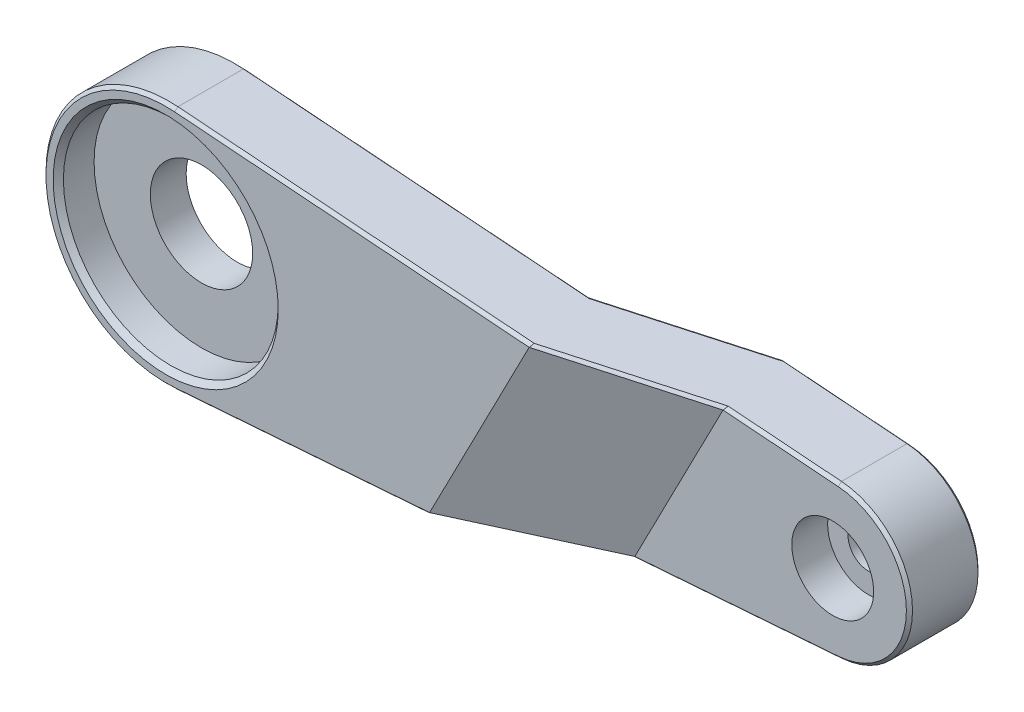
ISO-10303-21;
HEADER;
FILE_DESCRIPTION(('STEP AP214'),'2;1');
FILE_NAME('part.step','',(''),(''),'','','');
FILE_SCHEMA(('AUTOMOTIVE_DESIGN { 1 0 10303 214 1 1 1 1 }'));
ENDSEC;
DATA;
#1=APPLICATION_CONTEXT('core data for automotive mechanical design processes');
#2=APPLICATION_PROTOCOL_DEFINITION('international standard','automotive_design',2000,#1);
#3=PRODUCT_CONTEXT('',#1,'mechanical');
#4=PRODUCT('Part','Part','',(#3));
#5=PRODUCT_RELATED_PRODUCT_CATEGORY('part','',(#4));
#6=PRODUCT_DEFINITION_FORMATION('','',#4);
#7=PRODUCT_DEFINITION_CONTEXT('part definition',#1,'design');
#8=PRODUCT_DEFINITION('design','',#6,#7);
#9=PRODUCT_DEFINITION_SHAPE('','',#8);
#10=(LENGTH_UNIT() NAMED_UNIT(*) SI_UNIT(.MILLI.,.METRE.));
#11=(NAMED_UNIT(*) PLANE_ANGLE_UNIT() SI_UNIT($,.RADIAN.));
#12=(NAMED_UNIT(*) SI_UNIT($,.STERADIAN.) SOLID_ANGLE_UNIT());
#13=UNCERTAINTY_MEASURE_WITH_UNIT(LENGTH_MEASURE(1.E-05),#10,'distance_accuracy_value','');
#14=(GEOMETRIC_REPRESENTATION_CONTEXT(3) GLOBAL_UNCERTAINTY_ASSIGNED_CONTEXT((#13)) GLOBAL_UNIT_ASSIGNED_CONTEXT((#10,
#11,#12)) REPRESENTATION_CONTEXT('',''));
#15=CARTESIAN_POINT('',(0.,0.,0.));
#16=DIRECTION('',(0.,0.,1.));
#17=DIRECTION('',(1.,0.,0.));
#18=AXIS2_PLACEMENT_3D('',#15,#16,#17);
#19=CARTESIAN_POINT('',(0.,0.,7.));
#20=DIRECTION('',(0.,0.,-1.));
#21=DIRECTION('',(-1.,0.,0.));
#22=AXIS2_PLACEMENT_3D('',#19,#20,#21);
#23=CYLINDRICAL_SURFACE('',#22,12.);
#24=DIRECTION('',(0.,0.,-1.));
#25=VECTOR('',#24,1.);
#26=CARTESIAN_POINT('',(0.9,11.9662024051075,7.));
#27=LINE('',#26,#25);
#28=CARTESIAN_POINT('',(0.9,11.9662024051075,6.69999999999998));
#29=VERTEX_POINT('',#28);
#30=CARTESIAN_POINT('',(0.9,11.9662024051075,0.300000000000002));
#31=VERTEX_POINT('',#30);
#32=EDGE_CURVE('E383',#29,#31,#27,.T.);
#33=ORIENTED_EDGE('',*,*,#32,.T.);
#34=CARTESIAN_POINT('',(0.,0.,0.300000000000002));
#35=DIRECTION('',(0.,0.,1.));
#36=DIRECTION('',(1.,0.,0.));
#37=AXIS2_PLACEMENT_3D('',#34,#35,#36);
#38=CIRCLE('',#37,12.);
#39=CARTESIAN_POINT('',(0.9,-11.9662024051075,0.300000000000002));
#40=VERTEX_POINT('',#39);
#41=EDGE_CURVE('E200',#31,#40,#38,.T.);
#42=ORIENTED_EDGE('',*,*,#41,.T.);
#43=DIRECTION('',(0.,0.,-1.));
#44=VECTOR('',#43,1.);
#45=CARTESIAN_POINT('',(0.9,-11.9662024051075,7.));
#46=LINE('',#45,#44);
#47=CARTESIAN_POINT('',(0.9,-11.9662024051075,6.69999999999998));
#48=VERTEX_POINT('',#47);
#49=EDGE_CURVE('E185',#48,#40,#46,.T.);
#50=ORIENTED_EDGE('',*,*,#49,.F.);
#51=CARTESIAN_POINT('',(0.,0.,6.69999999999998));
#52=DIRECTION('',(0.,0.,1.));
#53=DIRECTION('',(1.,0.,0.));
#54=AXIS2_PLACEMENT_3D('',#51,#52,#53);
#55=CIRCLE('',#54,12.);
#56=EDGE_CURVE('E197',#48,#29,#55,.F.);
#57=ORIENTED_EDGE('',*,*,#56,.T.);
#58=EDGE_LOOP('',(#33,#42,#50,#57));
#59=FACE_BOUND('',#58,.T.);
#60=ADVANCED_FACE('F39',(#59),#23,.T.);
#61=CARTESIAN_POINT('',(0.9,-11.9662024051075,7.));
#62=DIRECTION('',(-0.075,0.997183533758957,0.));
#63=DIRECTION('',(-0.997183533758957,-0.075,0.));
#64=AXIS2_PLACEMENT_3D('',#61,#62,#63);
#65=PLANE('',#64);
#66=DIRECTION('',(0.941535676249198,0.070814622712933,-0.329387096832876));
#67=VECTOR('',#66,1.);
#68=CARTESIAN_POINT('',(1.35682953597985,-11.9318434189845,8.31320998572072));
#69=LINE('',#68,#67);
#70=CARTESIAN_POINT('',(24.2621684377657,-10.2090909271155,0.300000000000002));
#71=VERTEX_POINT('',#70);
#72=CARTESIAN_POINT('',(39.1260946922298,-9.09114780897909,-4.90000000000008));
#73=VERTEX_POINT('',#72);
#74=EDGE_CURVE('E419',#71,#73,#69,.T.);
#75=ORIENTED_EDGE('',*,*,#74,.T.);
#76=DIRECTION('',(0.997183533758957,0.075,0.));
#77=VECTOR('',#76,1.);
#78=CARTESIAN_POINT('',(60.5625,-7.47887650319217,-4.90000000000009));
#79=LINE('',#78,#77);
#80=CARTESIAN_POINT('',(60.5625,-7.47887650319218,-4.90000000000009));
#81=VERTEX_POINT('',#80);
#82=EDGE_CURVE('E356',#73,#81,#79,.T.);
#83=ORIENTED_EDGE('',*,*,#82,.T.);
#84=DIRECTION('',(0.,0.,-1.));
#85=VECTOR('',#84,1.);
#86=CARTESIAN_POINT('',(60.5625,-7.47887650319218,7.));
#87=LINE('',#86,#85);
#88=CARTESIAN_POINT('',(60.5625,-7.47887650319218,1.49999999999995));
#89=VERTEX_POINT('',#88);
#90=EDGE_CURVE('E202',#89,#81,#87,.T.);
#91=ORIENTED_EDGE('',*,*,#90,.F.);
#92=DIRECTION('',(-0.997183533758957,-0.075,0.));
#93=VECTOR('',#92,1.);
#94=CARTESIAN_POINT('',(0.900000000000104,-11.9662024051075,1.4999999999989));
#95=LINE('',#94,#93);
#96=CARTESIAN_POINT('',(40.1925645323235,-9.01093665897593,1.49999999999965));
#97=VERTEX_POINT('',#96);
#98=EDGE_CURVE('E416',#89,#97,#95,.T.);
#99=ORIENTED_EDGE('',*,*,#98,.T.);
#100=DIRECTION('',(-0.941535676249198,-0.070814622712933,0.329387096832876));
#101=VECTOR('',#100,1.);
#102=CARTESIAN_POINT('',(3.45736719694706,-11.7738581341908,14.3514514182674));
#103=LINE('',#102,#101);
#104=CARTESIAN_POINT('',(25.3286382778586,-10.1288797771124,6.69999999999998));
#105=VERTEX_POINT('',#104);
#106=EDGE_CURVE('E188',#97,#105,#103,.T.);
#107=ORIENTED_EDGE('',*,*,#106,.T.);
#108=DIRECTION('',(-0.997183533758957,-0.075,0.));
#109=VECTOR('',#108,1.);
#110=CARTESIAN_POINT('',(0.9,-11.9662024051075,6.69999999999998));
#111=LINE('',#110,#109);
#112=EDGE_CURVE('E181',#105,#48,#111,.T.);
#113=ORIENTED_EDGE('',*,*,#112,.T.);
#114=ORIENTED_EDGE('',*,*,#49,.T.);
#115=DIRECTION('',(0.997183533758957,0.075,0.));
#116=VECTOR('',#115,1.);
#117=CARTESIAN_POINT('',(0.9,-11.9662024051075,0.300000000000002));
#118=LINE('',#117,#116);
#119=EDGE_CURVE('E345',#40,#71,#118,.T.);
#120=ORIENTED_EDGE('',*,*,#119,.T.);
#121=EDGE_LOOP('',(#75,#83,#91,#99,#107,#113,#114,#120));
#122=FACE_BOUND('',#121,.T.);
#123=ADVANCED_FACE('F184',(#122),#65,.F.);
#124=CARTESIAN_POINT('',(60.,0.,7.));
#125=DIRECTION('',(0.,0.,-1.));
#126=DIRECTION('',(-1.,0.,0.));
#127=AXIS2_PLACEMENT_3D('',#124,#125,#126);
#128=CYLINDRICAL_SURFACE('',#127,7.5);
#129=DIRECTION('',(0.,0.,-1.));
#130=VECTOR('',#129,1.);
#131=CARTESIAN_POINT('',(60.5625,7.47887650319218,7.));
#132=LINE('',#131,#130);
#133=CARTESIAN_POINT('',(60.5625,7.47887650319218,1.49999999999989));
#134=VERTEX_POINT('',#133);
#135=CARTESIAN_POINT('',(60.5625,7.47887650319218,-4.90000000000009));
#136=VERTEX_POINT('',#135);
#137=EDGE_CURVE('E389',#134,#136,#132,.T.);
#138=ORIENTED_EDGE('',*,*,#137,.F.);
#139=CARTESIAN_POINT('',(60.,0.,1.49999999999995));
#140=DIRECTION('',(0.,0.,-1.));
#141=DIRECTION('',(-1.,0.,0.));
#142=AXIS2_PLACEMENT_3D('',#139,#140,#141);
#143=CIRCLE('',#142,7.5);
#144=EDGE_CURVE('E291',#134,#89,#143,.T.);
#145=ORIENTED_EDGE('',*,*,#144,.T.);
#146=ORIENTED_EDGE('',*,*,#90,.T.);
#147=CARTESIAN_POINT('',(60.,0.,-4.90000000000009));
#148=DIRECTION('',(0.,0.,-1.));
#149=DIRECTION('',(-1.,0.,0.));
#150=AXIS2_PLACEMENT_3D('',#147,#148,#149);
#151=CIRCLE('',#150,7.5);
#152=EDGE_CURVE('E289',#81,#136,#151,.F.);
#153=ORIENTED_EDGE('',*,*,#152,.T.);
#154=EDGE_LOOP('',(#138,#145,#146,#153));
#155=FACE_BOUND('',#154,.T.);
#156=ADVANCED_FACE('F391',(#155),#128,.T.);
#157=CARTESIAN_POINT('',(0.9,11.9662024051075,7.));
#158=DIRECTION('',(-0.075,-0.997183533758957,0.));
#159=DIRECTION('',(0.997183533758957,-0.075,0.));
#160=AXIS2_PLACEMENT_3D('',#157,#158,#159);
#161=PLANE('',#160);
#162=ORIENTED_EDGE('',*,*,#137,.T.);
#163=DIRECTION('',(-0.997183533758957,0.075,0.));
#164=VECTOR('',#163,1.);
#165=CARTESIAN_POINT('',(48.2409446123397,8.40560325186902,-4.90000000000009));
#166=LINE('',#165,#164);
#167=CARTESIAN_POINT('',(48.4559369675978,8.38943328305337,-4.90000000000009));
#168=VERTEX_POINT('',#167);
#169=EDGE_CURVE('E303',#136,#168,#166,.T.);
#170=ORIENTED_EDGE('',*,*,#169,.T.);
#171=DIRECTION('',(-0.933066204918891,0.0701776182616275,0.352792515699219));
#172=VECTOR('',#171,1.);
#173=CARTESIAN_POINT('',(2.9017062093807,11.8156504148057,12.3240636143617));
#174=LINE('',#173,#172);
#175=CARTESIAN_POINT('',(34.7029687223334,9.42381921450435,0.300000000000002));
#176=VERTEX_POINT('',#175);
#177=EDGE_CURVE('E301',#168,#176,#174,.T.);
#178=ORIENTED_EDGE('',*,*,#177,.T.);
#179=DIRECTION('',(-0.997183533758957,0.075,0.));
#180=VECTOR('',#179,1.);
#181=CARTESIAN_POINT('',(0.9,11.9662024051075,0.300000000000002));
#182=LINE('',#181,#180);
#183=EDGE_CURVE('E299',#176,#31,#182,.T.);
#184=ORIENTED_EDGE('',*,*,#183,.T.);
#185=ORIENTED_EDGE('',*,*,#32,.F.);
#186=DIRECTION('',(0.997183533758957,-0.075,0.));
#187=VECTOR('',#186,1.);
#188=CARTESIAN_POINT('',(35.6761386879196,9.3506253189495,6.69999999999998));
#189=LINE('',#188,#187);
#190=CARTESIAN_POINT('',(35.7238367707991,9.34703785877305,6.69999999999998));
#191=VERTEX_POINT('',#190);
#192=EDGE_CURVE('E293',#29,#191,#189,.T.);
#193=ORIENTED_EDGE('',*,*,#192,.T.);
#194=DIRECTION('',(0.933066204918891,-0.0701776182616275,-0.352792515699219));
#195=VECTOR('',#194,1.);
#196=CARTESIAN_POINT('',(5.13551021121271,11.647641924427,18.2654522916986));
#197=LINE('',#196,#195);
#198=CARTESIAN_POINT('',(49.4768050160642,8.31265192732204,1.49999999999966));
#199=VERTEX_POINT('',#198);
#200=EDGE_CURVE('E295',#191,#199,#197,.T.);
#201=ORIENTED_EDGE('',*,*,#200,.T.);
#202=DIRECTION('',(0.997183533758957,-0.075,0.));
#203=VECTOR('',#202,1.);
#204=CARTESIAN_POINT('',(0.900000000000113,11.9662024051075,1.49999999999866));
#205=LINE('',#204,#203);
#206=EDGE_CURVE('E297',#199,#134,#205,.T.);
#207=ORIENTED_EDGE('',*,*,#206,.T.);
#208=EDGE_LOOP('',(#162,#170,#178,#184,#185,#193,#201,#207));
#209=FACE_BOUND('',#208,.T.);
#210=ADVANCED_FACE('F382',(#209),#161,.F.);
#211=CARTESIAN_POINT('',(0.,0.,7.));
#212=DIRECTION('',(0.,0.,1.));
#213=DIRECTION('',(1.,0.,0.));
#214=AXIS2_PLACEMENT_3D('',#211,#212,#213);
#215=PLANE('',#214);
#216=CARTESIAN_POINT('',(0.,0.,7.));
#217=DIRECTION('',(0.,0.,1.));
#218=DIRECTION('',(1.,0.,0.));
#219=AXIS2_PLACEMENT_3D('',#216,#217,#218);
#220=CIRCLE('',#219,11.);
#221=CARTESIAN_POINT('',(11.,0.,7.));
#222=VERTEX_POINT('',#221);
#223=EDGE_CURVE('E407',#222,#222,#220,.F.);
#224=ORIENTED_EDGE('',*,*,#223,.T.);
#225=EDGE_LOOP('',(#224));
#226=FACE_BOUND('',#225,.T.);
#227=CARTESIAN_POINT('',(0.,0.,7.));
#228=DIRECTION('',(0.,0.,1.));
#229=DIRECTION('',(1.,0.,0.));
#230=AXIS2_PLACEMENT_3D('',#227,#228,#229);
#231=CIRCLE('',#230,11.7);
#232=CARTESIAN_POINT('',(0.877499999999998,11.6670473449798,7.));
#233=VERTEX_POINT('',#232);
#234=CARTESIAN_POINT('',(0.877499999999998,-11.6670473449798,7.));
#235=VERTEX_POINT('',#234);
#236=EDGE_CURVE('E319',#233,#235,#231,.T.);
#237=ORIENTED_EDGE('',*,*,#236,.T.);
#238=DIRECTION('',(0.997183533758957,0.075,0.));
#239=VECTOR('',#238,1.);
#240=CARTESIAN_POINT('',(25.6108183311687,-9.80680917212798,7.));
#241=LINE('',#240,#239);
#242=CARTESIAN_POINT('',(25.7948773472861,-9.79296575640613,7.));
#243=VERTEX_POINT('',#242);
#244=EDGE_CURVE('E217',#235,#243,#241,.T.);
#245=ORIENTED_EDGE('',*,*,#244,.T.);
#246=DIRECTION('',(-0.458668511465496,-0.888607447971277,0.));
#247=VECTOR('',#246,1.);
#248=CARTESIAN_POINT('',(24.3596138192417,-12.573592350429,7.));
#249=LINE('',#248,#247);
#250=CARTESIAN_POINT('',(35.5266548987537,9.06102094218651,7.));
#251=VERTEX_POINT('',#250);
#252=EDGE_CURVE('E372',#251,#243,#249,.T.);
#253=ORIENTED_EDGE('',*,*,#252,.F.);
#254=DIRECTION('',(-0.997183533758957,0.075,0.));
#255=VECTOR('',#254,1.);
#256=CARTESIAN_POINT('',(0.877499999999998,11.6670473449798,7.));
#257=LINE('',#256,#255);
#258=EDGE_CURVE('E317',#251,#233,#257,.T.);
#259=ORIENTED_EDGE('',*,*,#258,.T.);
#260=EDGE_LOOP('',(#237,#245,#253,#259));
#261=FACE_BOUND('',#260,.T.);
#262=ADVANCED_FACE('F375',(#226,#261),#215,.T.);
#263=CARTESIAN_POINT('',(0.,0.,0.));
#264=DIRECTION('',(0.,0.,1.));
#265=DIRECTION('',(1.,0.,0.));
#266=AXIS2_PLACEMENT_3D('',#263,#264,#265);
#267=PLANE('',#266);
#268=CARTESIAN_POINT('',(0.,0.,0.));
#269=DIRECTION('',(0.,0.,-1.));
#270=DIRECTION('',(-1.,0.,0.));
#271=AXIS2_PLACEMENT_3D('',#268,#269,#270);
#272=CIRCLE('',#271,5.);
#273=CARTESIAN_POINT('',(-5.,0.,0.));
#274=VERTEX_POINT('',#273);
#275=EDGE_CURVE('E340',#274,#274,#272,.T.);
#276=ORIENTED_EDGE('',*,*,#275,.F.);
#277=EDGE_LOOP('',(#276));
#278=FACE_BOUND('',#277,.T.);
#279=DIRECTION('',(-0.458668511465496,-0.888607447971277,0.));
#280=VECTOR('',#279,1.);
#281=CARTESIAN_POINT('',(23.3849907001771,-12.0705255167199,0.));
#282=LINE('',#281,#280);
#283=CARTESIAN_POINT('',(34.3384925779093,9.15038480655703,0.));
#284=VERTEX_POINT('',#283);
#285=CARTESIAN_POINT('',(24.51073585867,-9.88954838977872,0.));
#286=VERTEX_POINT('',#285);
#287=EDGE_CURVE('E330',#284,#286,#282,.T.);
#288=ORIENTED_EDGE('',*,*,#287,.T.);
#289=DIRECTION('',(-0.997183533758957,-0.075,0.));
#290=VECTOR('',#289,1.);
#291=CARTESIAN_POINT('',(0.877499999999999,-11.6670473449798,0.));
#292=LINE('',#291,#290);
#293=CARTESIAN_POINT('',(0.8775,-11.6670473449798,0.));
#294=VERTEX_POINT('',#293);
#295=EDGE_CURVE('E213',#286,#294,#292,.T.);
#296=ORIENTED_EDGE('',*,*,#295,.T.);
#297=CARTESIAN_POINT('',(0.,0.,0.));
#298=DIRECTION('',(0.,0.,1.));
#299=DIRECTION('',(1.,0.,0.));
#300=AXIS2_PLACEMENT_3D('',#297,#298,#299);
#301=CIRCLE('',#300,11.7);
#302=CARTESIAN_POINT('',(0.8775,11.6670473449798,0.));
#303=VERTEX_POINT('',#302);
#304=EDGE_CURVE('E313',#294,#303,#301,.F.);
#305=ORIENTED_EDGE('',*,*,#304,.T.);
#306=DIRECTION('',(0.997183533758957,-0.075,0.));
#307=VECTOR('',#306,1.);
#308=CARTESIAN_POINT('',(0.8775,11.6670473449798,0.));
#309=LINE('',#308,#307);
#310=EDGE_CURVE('E311',#303,#284,#309,.T.);
#311=ORIENTED_EDGE('',*,*,#310,.T.);
#312=EDGE_LOOP('',(#288,#296,#305,#311));
#313=FACE_BOUND('',#312,.T.);
#314=ADVANCED_FACE('F337',(#278,#313),#267,.F.);
#315=CARTESIAN_POINT('',(0.,0.,3.5));
#316=DIRECTION('',(0.,0.,1.));
#317=DIRECTION('',(1.,0.,0.));
#318=AXIS2_PLACEMENT_3D('',#315,#316,#317);
#319=CYLINDRICAL_SURFACE('',#318,10.5);
#320=CARTESIAN_POINT('',(0.,0.,6.49999999999999));
#321=DIRECTION('',(0.,0.,1.));
#322=DIRECTION('',(1.,0.,0.));
#323=AXIS2_PLACEMENT_3D('',#320,#321,#322);
#324=CIRCLE('',#323,10.5);
#325=CARTESIAN_POINT('',(10.5,0.,6.49999999999999));
#326=VERTEX_POINT('',#325);
#327=EDGE_CURVE('E376',#326,#326,#324,.T.);
#328=ORIENTED_EDGE('',*,*,#327,.T.);
#329=EDGE_LOOP('',(#328));
#330=FACE_BOUND('',#329,.T.);
#331=CARTESIAN_POINT('',(0.,0.,3.5));
#332=DIRECTION('',(0.,0.,1.));
#333=DIRECTION('',(1.,0.,0.));
#334=AXIS2_PLACEMENT_3D('',#331,#332,#333);
#335=CIRCLE('',#334,10.5);
#336=CARTESIAN_POINT('',(10.5,0.,3.5));
#337=VERTEX_POINT('',#336);
#338=EDGE_CURVE('E397',#337,#337,#335,.T.);
#339=ORIENTED_EDGE('',*,*,#338,.F.);
#340=EDGE_LOOP('',(#339));
#341=FACE_BOUND('',#340,.T.);
#342=ADVANCED_FACE('F494',(#330,#341),#319,.F.);
#343=CARTESIAN_POINT('',(0.,0.,3.5));
#344=DIRECTION('',(0.,0.,1.));
#345=DIRECTION('',(1.,0.,0.));
#346=AXIS2_PLACEMENT_3D('',#343,#344,#345);
#347=PLANE('',#346);
#348=CARTESIAN_POINT('',(0.,0.,3.5));
#349=DIRECTION('',(0.,0.,1.));
#350=DIRECTION('',(1.,0.,0.));
#351=AXIS2_PLACEMENT_3D('',#348,#349,#350);
#352=CIRCLE('',#351,5.);
#353=CARTESIAN_POINT('',(5.,0.,3.5));
#354=VERTEX_POINT('',#353);
#355=EDGE_CURVE('E401',#354,#354,#352,.T.);
#356=ORIENTED_EDGE('',*,*,#355,.F.);
#357=EDGE_LOOP('',(#356));
#358=FACE_BOUND('',#357,.T.);
#359=ORIENTED_EDGE('',*,*,#338,.T.);
#360=EDGE_LOOP('',(#359));
#361=FACE_BOUND('',#360,.T.);
#362=ADVANCED_FACE('F492',(#358,#361),#347,.T.);
#363=CARTESIAN_POINT('',(0.,0.,7.));
#364=DIRECTION('',(0.,0.,-1.));
#365=DIRECTION('',(-1.,0.,0.));
#366=AXIS2_PLACEMENT_3D('',#363,#364,#365);
#367=CYLINDRICAL_SURFACE('',#366,5.);
#368=ORIENTED_EDGE('',*,*,#355,.T.);
#369=EDGE_LOOP('',(#368));
#370=FACE_BOUND('',#369,.T.);
#371=ORIENTED_EDGE('',*,*,#275,.T.);
#372=EDGE_LOOP('',(#371));
#373=FACE_BOUND('',#372,.T.);
#374=ADVANCED_FACE('F502',(#370,#373),#367,.F.);
#375=CARTESIAN_POINT('',(60.0901189151643,4.74914503686055,-5.20000000000011));
#376=DIRECTION('',(0.,0.,-1.));
#377=DIRECTION('',(-0.999820007759948,0.0189724031925023,0.));
#378=AXIS2_PLACEMENT_3D('',#375,#376,#377);
#379=PLANE('',#378);
#380=CARTESIAN_POINT('',(60.0000000000003,0.,-5.20000000000011));
#381=DIRECTION('',(0.,0.,-1.));
#382=DIRECTION('',(-1.,0.,0.));
#383=AXIS2_PLACEMENT_3D('',#380,#381,#382);
#384=CIRCLE('',#383,2.29999999999998);
#385=CARTESIAN_POINT('',(57.7000000000003,0.,-5.2000000000001));
#386=VERTEX_POINT('',#385);
#387=EDGE_CURVE('E192',#386,#386,#384,.F.);
#388=ORIENTED_EDGE('',*,*,#387,.T.);
#389=EDGE_LOOP('',(#388));
#390=FACE_BOUND('',#389,.T.);
#391=CARTESIAN_POINT('',(60.,0.,-5.20000000000011));
#392=DIRECTION('',(0.,0.,-1.));
#393=DIRECTION('',(-1.,0.,0.));
#394=AXIS2_PLACEMENT_3D('',#391,#392,#393);
#395=CIRCLE('',#394,7.19999999999999);
#396=CARTESIAN_POINT('',(60.54,7.17972144306448,-5.20000000000011));
#397=VERTEX_POINT('',#396);
#398=CARTESIAN_POINT('',(60.54,-7.17972144306448,-5.2000000000001));
#399=VERTEX_POINT('',#398);
#400=EDGE_CURVE('E307',#397,#399,#395,.T.);
#401=ORIENTED_EDGE('',*,*,#400,.T.);
#402=DIRECTION('',(-0.997183533758957,-0.075,0.));
#403=VECTOR('',#402,1.);
#404=CARTESIAN_POINT('',(39.1906030970173,-8.78544868736408,-5.2000000000001));
#405=LINE('',#404,#403);
#406=CARTESIAN_POINT('',(39.3746621131342,-8.77160527164227,-5.2000000000001));
#407=VERTEX_POINT('',#406);
#408=EDGE_CURVE('E309',#399,#407,#405,.T.);
#409=ORIENTED_EDGE('',*,*,#408,.T.);
#410=DIRECTION('',(-0.458668511465497,-0.888607447971277,0.));
#411=VECTOR('',#410,1.);
#412=CARTESIAN_POINT('',(49.2434504777763,10.3478211203153,-5.2000000000001));
#413=LINE('',#412,#411);
#414=CARTESIAN_POINT('',(48.0914608231738,8.11599887510604,-5.2000000000001));
#415=VERTEX_POINT('',#414);
#416=EDGE_CURVE('E201',#415,#407,#413,.T.);
#417=ORIENTED_EDGE('',*,*,#416,.F.);
#418=DIRECTION('',(0.997183533758957,-0.075,0.));
#419=VECTOR('',#418,1.);
#420=CARTESIAN_POINT('',(60.54,7.17972144306448,-5.20000000000011));
#421=LINE('',#420,#419);
#422=EDGE_CURVE('E305',#415,#397,#421,.T.);
#423=ORIENTED_EDGE('',*,*,#422,.T.);
#424=EDGE_LOOP('',(#401,#409,#417,#423));
#425=FACE_BOUND('',#424,.T.);
#426=ADVANCED_FACE('F430',(#390,#425),#379,.T.);
#427=CARTESIAN_POINT('',(6.24293209465623,-45.2809172694833,0.));
#428=DIRECTION('',(0.336811869793672,-0.17385066861061,0.925383006862421));
#429=DIRECTION('',(0.93969262078591,0.,-0.342020143325663));
#430=AXIS2_PLACEMENT_3D('',#427,#428,#429);
#431=PLANE('',#430);
#432=DIRECTION('',(-0.903924125615139,-0.334833953958065,0.266096596009257));
#433=VECTOR('',#432,1.);
#434=CARTESIAN_POINT('',(57.5237758330273,-2.04876279464686,-10.5427242891233));
#435=LINE('',#434,#433);
#436=CARTESIAN_POINT('',(39.3543578918002,-8.77912641475442,-5.19402285653365));
#437=VERTEX_POINT('',#436);
#438=EDGE_CURVE('E365',#407,#437,#435,.T.);
#439=ORIENTED_EDGE('',*,*,#438,.T.);
#440=DIRECTION('',(-0.941535676249198,-0.0708146227129331,0.329387096832876));
#441=VECTOR('',#440,1.);
#442=CARTESIAN_POINT('',(5.95686973249283,-11.2910126695404,6.48976347658565));
#443=LINE('',#442,#441);
#444=CARTESIAN_POINT('',(24.4904316373361,-9.89706953289087,0.00597714346643889));
#445=VERTEX_POINT('',#444);
#446=EDGE_CURVE('E332',#437,#445,#443,.T.);
#447=ORIENTED_EDGE('',*,*,#446,.T.);
#448=DIRECTION('',(-0.903924125615138,-0.334833953958071,0.266096596009255));
#449=VECTOR('',#448,1.);
#450=CARTESIAN_POINT('',(-1.12721035280174,-19.3864239107297,7.5472819257904));
#451=LINE('',#450,#449);
#452=EDGE_CURVE('E49',#445,#286,#451,.F.);
#453=ORIENTED_EDGE('',*,*,#452,.T.);
#454=ORIENTED_EDGE('',*,*,#287,.F.);
#455=DIRECTION('',(0.813457286554083,-0.441217187612397,-0.378965217806958));
#456=VECTOR('',#455,1.);
#457=CARTESIAN_POINT('',(35.2833131498285,8.63791650314256,-0.440163410844356));
#458=LINE('',#457,#456);
#459=CARTESIAN_POINT('',(34.3313912623988,9.15423654224083,0.00330828873699548));
#460=VERTEX_POINT('',#459);
#461=EDGE_CURVE('E11',#284,#460,#458,.F.);
#462=ORIENTED_EDGE('',*,*,#461,.T.);
#463=DIRECTION('',(0.933066204918891,-0.0701776182616276,-0.352792515699219));
#464=VECTOR('',#463,1.);
#465=CARTESIAN_POINT('',(13.4427491053507,10.7253095781874,7.90130799902163));
#466=LINE('',#465,#464);
#467=CARTESIAN_POINT('',(48.0843595076633,8.11985061078984,-5.19669171126311));
#468=VERTEX_POINT('',#467);
#469=EDGE_CURVE('E57',#460,#468,#466,.T.);
#470=ORIENTED_EDGE('',*,*,#469,.T.);
#471=DIRECTION('',(0.813457286554089,-0.441217187612387,-0.378965217806958));
#472=VECTOR('',#471,1.);
#473=CARTESIAN_POINT('',(56.4819581538421,3.56501421235997,-9.10887966827999));
#474=LINE('',#473,#472);
#475=EDGE_CURVE('E354',#468,#415,#474,.T.);
#476=ORIENTED_EDGE('',*,*,#475,.T.);
#477=ORIENTED_EDGE('',*,*,#416,.T.);
#478=EDGE_LOOP('',(#439,#447,#453,#454,#462,#470,#476,#477));
#479=FACE_BOUND('',#478,.T.);
#480=ADVANCED_FACE('F329',(#479),#431,.F.);
#481=CARTESIAN_POINT('',(21.7641035407807,-45.2809172694833,1.79999999999965));
#482=DIRECTION('',(0.,0.,-1.));
#483=DIRECTION('',(-1.,0.,0.));
#484=AXIS2_PLACEMENT_3D('',#481,#482,#483);
#485=PLANE('',#484);
#486=CARTESIAN_POINT('',(60.0000000000003,0.,1.80000000000003));
#487=DIRECTION('',(0.,0.,-1.));
#488=DIRECTION('',(-1.,0.,0.));
#489=AXIS2_PLACEMENT_3D('',#486,#487,#488);
#490=CIRCLE('',#489,4.00000000000001);
#491=CARTESIAN_POINT('',(56.0000000000003,0.,1.80000000000003));
#492=VERTEX_POINT('',#491);
#493=EDGE_CURVE('E269',#492,#492,#490,.T.);
#494=ORIENTED_EDGE('',*,*,#493,.T.);
#495=EDGE_LOOP('',(#494));
#496=FACE_BOUND('',#495,.T.);
#497=DIRECTION('',(0.458668511465496,0.888607447971277,0.));
#498=VECTOR('',#497,1.);
#499=CARTESIAN_POINT('',(21.7641035407807,-45.2809172694833,1.79999999999965));
#500=LINE('',#499,#498);
#501=CARTESIAN_POINT('',(40.658803601751,-8.67502263826964,1.79999999999965));
#502=VERTEX_POINT('',#501);
#503=CARTESIAN_POINT('',(49.2796231440188,8.02663501073552,1.79999999999965));
#504=VERTEX_POINT('',#503);
#505=EDGE_CURVE('E341',#502,#504,#500,.T.);
#506=ORIENTED_EDGE('',*,*,#505,.F.);
#507=DIRECTION('',(0.997183533758957,0.075,0.));
#508=VECTOR('',#507,1.);
#509=CARTESIAN_POINT('',(19.1326765762666,-10.2940420787788,1.79999999999924));
#510=LINE('',#509,#508);
#511=CARTESIAN_POINT('',(60.54,-7.17972144306456,1.80000000000003));
#512=VERTEX_POINT('',#511);
#513=EDGE_CURVE('E287',#502,#512,#510,.T.);
#514=ORIENTED_EDGE('',*,*,#513,.T.);
#515=CARTESIAN_POINT('',(60.,0.,1.79999999999995));
#516=DIRECTION('',(0.,0.,-1.));
#517=DIRECTION('',(-1.,0.,0.));
#518=AXIS2_PLACEMENT_3D('',#515,#516,#517);
#519=CIRCLE('',#518,7.20000000000007);
#520=CARTESIAN_POINT('',(60.54,7.1797214430645,1.79999999999988));
#521=VERTEX_POINT('',#520);
#522=EDGE_CURVE('E285',#512,#521,#519,.F.);
#523=ORIENTED_EDGE('',*,*,#522,.T.);
#524=DIRECTION('',(-0.997183533758957,0.075,0.));
#525=VECTOR('',#524,1.);
#526=CARTESIAN_POINT('',(25.9056843404611,9.78463175949709,1.79999999999917));
#527=LINE('',#526,#525);
#528=EDGE_CURVE('E278',#521,#504,#527,.T.);
#529=ORIENTED_EDGE('',*,*,#528,.T.);
#530=EDGE_LOOP('',(#506,#514,#523,#529));
#531=FACE_BOUND('',#530,.T.);
#532=ADVANCED_FACE('F550',(#496,#531),#485,.F.);
#533=CARTESIAN_POINT('',(7.47722095961547,-45.2809172694833,7.));
#534=DIRECTION('',(-0.336811869793672,0.17385066861061,-0.925383006862421));
#535=DIRECTION('',(-0.93969262078591,0.,0.342020143325663));
#536=AXIS2_PLACEMENT_3D('',#533,#534,#535);
#537=PLANE('',#536);
#538=DIRECTION('',(0.872608126687251,-0.311569515596265,-0.376137600075392));
#539=VECTOR('',#538,1.);
#540=CARTESIAN_POINT('',(7.33118810464853,-3.20040428750477,14.95877043528));
#541=LINE('',#540,#539);
#542=CARTESIAN_POINT('',(25.8087438258359,-9.7979168585935,6.99402285653355));
#543=VERTEX_POINT('',#542);
#544=EDGE_CURVE('E274',#243,#543,#541,.T.);
#545=ORIENTED_EDGE('',*,*,#544,.T.);
#546=DIRECTION('',(0.941535676249198,0.0708146227129331,-0.329387096832876));
#547=VECTOR('',#546,1.);
#548=CARTESIAN_POINT('',(7.19037779901799,-11.1982382685827,13.5074770867291));
#549=LINE('',#548,#547);
#550=CARTESIAN_POINT('',(40.6726700803007,-8.67997374045701,1.79402285653323));
#551=VERTEX_POINT('',#550);
#552=EDGE_CURVE('E273',#543,#551,#549,.T.);
#553=ORIENTED_EDGE('',*,*,#552,.T.);
#554=DIRECTION('',(0.872608126687245,-0.311569515596282,-0.376137600075393));
#555=VECTOR('',#554,1.);
#556=CARTESIAN_POINT('',(23.6384482919249,-2.59781146297215,9.13662156341884));
#557=LINE('',#556,#555);
#558=EDGE_CURVE('E322',#551,#502,#557,.F.);
#559=ORIENTED_EDGE('',*,*,#558,.T.);
#560=ORIENTED_EDGE('',*,*,#505,.T.);
#561=DIRECTION('',(-0.928202229687935,-0.226338356647851,0.295316049533879));
#562=VECTOR('',#561,1.);
#563=CARTESIAN_POINT('',(0.639719148709855,-3.83400869996619,17.2752314077405));
#564=LINE('',#563,#562);
#565=CARTESIAN_POINT('',(49.290021363103,8.02917057437058,1.79669171126265));
#566=VERTEX_POINT('',#565);
#567=EDGE_CURVE('E324',#504,#566,#564,.F.);
#568=ORIENTED_EDGE('',*,*,#567,.T.);
#569=DIRECTION('',(-0.933066204918891,0.0701776182616276,0.352792515699219));
#570=VECTOR('',#569,1.);
#571=CARTESIAN_POINT('',(14.6652181956935,10.6333654388472,14.888336602723));
#572=LINE('',#571,#570);
#573=CARTESIAN_POINT('',(35.537053117838,9.06355650582159,6.99669171126297));
#574=VERTEX_POINT('',#573);
#575=EDGE_CURVE('E64',#566,#574,#572,.T.);
#576=ORIENTED_EDGE('',*,*,#575,.T.);
#577=DIRECTION('',(-0.928202229687937,-0.22633835664784,0.295316049533882));
#578=VECTOR('',#577,1.);
#579=CARTESIAN_POINT('',(6.22184478295924,1.91516161181636,16.3235940174875));
#580=LINE('',#579,#578);
#581=EDGE_CURVE('E280',#574,#251,#580,.T.);
#582=ORIENTED_EDGE('',*,*,#581,.T.);
#583=ORIENTED_EDGE('',*,*,#252,.T.);
#584=EDGE_LOOP('',(#545,#553,#559,#560,#568,#576,#582,#583));
#585=FACE_BOUND('',#584,.T.);
#586=ADVANCED_FACE('F371',(#585),#537,.F.);
#587=CARTESIAN_POINT('',(60.0000000000003,0.,-13.4500000000002));
#588=DIRECTION('',(0.,0.,-1.));
#589=DIRECTION('',(-1.,0.,0.));
#590=AXIS2_PLACEMENT_3D('',#587,#588,#589);
#591=CYLINDRICAL_SURFACE('',#590,2.00000000000001);
#592=CARTESIAN_POINT('',(60.0000000000003,0.,-4.90000000000018));
#593=DIRECTION('',(0.,0.,-1.));
#594=DIRECTION('',(-1.,0.,0.));
#595=AXIS2_PLACEMENT_3D('',#592,#593,#594);
#596=CIRCLE('',#595,2.00000000000001);
#597=CARTESIAN_POINT('',(58.0000000000003,0.,-4.90000000000014));
#598=VERTEX_POINT('',#597);
#599=EDGE_CURVE('E410',#598,#598,#596,.T.);
#600=ORIENTED_EDGE('',*,*,#599,.T.);
#601=EDGE_LOOP('',(#600));
#602=FACE_BOUND('',#601,.T.);
#603=CARTESIAN_POINT('',(60.0000000000003,0.,-1.7000000000002));
#604=DIRECTION('',(0.,0.,-1.));
#605=DIRECTION('',(-1.,0.,0.));
#606=AXIS2_PLACEMENT_3D('',#603,#604,#605);
#607=CIRCLE('',#606,2.00000000000001);
#608=CARTESIAN_POINT('',(58.0000000000003,0.,-1.7000000000002));
#609=VERTEX_POINT('',#608);
#610=EDGE_CURVE('E478',#609,#609,#607,.T.);
#611=ORIENTED_EDGE('',*,*,#610,.F.);
#612=EDGE_LOOP('',(#611));
#613=FACE_BOUND('',#612,.T.);
#614=ADVANCED_FACE('F471',(#602,#613),#591,.F.);
#615=CARTESIAN_POINT('',(58.0000000000003,0.,-1.7000000000002));
#616=DIRECTION('',(0.,0.,-1.));
#617=DIRECTION('',(-1.,0.,0.));
#618=AXIS2_PLACEMENT_3D('',#615,#616,#617);
#619=PLANE('',#618);
#620=CARTESIAN_POINT('',(60.0000000000003,0.,-1.70000000000021));
#621=DIRECTION('',(0.,0.,-1.));
#622=DIRECTION('',(-1.,0.,0.));
#623=AXIS2_PLACEMENT_3D('',#620,#621,#622);
#624=CIRCLE('',#623,4.00000000000001);
#625=CARTESIAN_POINT('',(56.0000000000003,0.,-1.7000000000002));
#626=VERTEX_POINT('',#625);
#627=EDGE_CURVE('E480',#626,#626,#624,.T.);
#628=ORIENTED_EDGE('',*,*,#627,.F.);
#629=EDGE_LOOP('',(#628));
#630=FACE_BOUND('',#629,.T.);
#631=ORIENTED_EDGE('',*,*,#610,.T.);
#632=EDGE_LOOP('',(#631));
#633=FACE_BOUND('',#632,.T.);
#634=ADVANCED_FACE('F474',(#630,#633),#619,.F.);
#635=CARTESIAN_POINT('',(60.0000000000003,0.,-13.4500000000002));
#636=DIRECTION('',(0.,0.,-1.));
#637=DIRECTION('',(-1.,0.,0.));
#638=AXIS2_PLACEMENT_3D('',#635,#636,#637);
#639=CYLINDRICAL_SURFACE('',#638,4.00000000000001);
#640=ORIENTED_EDGE('',*,*,#493,.F.);
#641=EDGE_LOOP('',(#640));
#642=FACE_BOUND('',#641,.T.);
#643=ORIENTED_EDGE('',*,*,#627,.T.);
#644=EDGE_LOOP('',(#643));
#645=FACE_BOUND('',#644,.T.);
#646=ADVANCED_FACE('F456',(#642,#645),#639,.F.);
#647=CARTESIAN_POINT('',(0.,0.,6.49999999999999));
#648=DIRECTION('',(0.,0.,1.));
#649=DIRECTION('',(1.,0.,0.));
#650=AXIS2_PLACEMENT_3D('',#647,#648,#649);
#651=CONICAL_SURFACE('',#650,10.5,0.785398163397452);
#652=ORIENTED_EDGE('',*,*,#223,.F.);
#653=EDGE_LOOP('',(#652));
#654=FACE_BOUND('',#653,.T.);
#655=ORIENTED_EDGE('',*,*,#327,.F.);
#656=EDGE_LOOP('',(#655));
#657=FACE_BOUND('',#656,.T.);
#658=ADVANCED_FACE('F450',(#654,#657),#651,.F.);
#659=CARTESIAN_POINT('',(60.0000000000003,0.,-4.90000000000018));
#660=DIRECTION('',(0.,0.,-1.));
#661=DIRECTION('',(-1.,0.,0.));
#662=AXIS2_PLACEMENT_3D('',#659,#660,#661);
#663=CONICAL_SURFACE('',#662,2.00000000000001,0.785398163397437);
#664=ORIENTED_EDGE('',*,*,#387,.F.);
#665=EDGE_LOOP('',(#664));
#666=FACE_BOUND('',#665,.T.);
#667=ORIENTED_EDGE('',*,*,#599,.F.);
#668=EDGE_LOOP('',(#667));
#669=FACE_BOUND('',#668,.T.);
#670=ADVANCED_FACE('F455',(#666,#669),#663,.F.);
#671=CARTESIAN_POINT('',(2.9017062093807,11.8156504148057,12.3240636143617));
#672=DIRECTION('',(0.148872479559503,-0.817499574704979,0.556355489041839));
#673=DIRECTION('',(-0.933066204918891,0.0701776182616275,0.352792515699219));
#674=AXIS2_PLACEMENT_3D('',#671,#672,#673);
#675=PLANE('',#674);
#676=ORIENTED_EDGE('',*,*,#469,.F.);
#677=DIRECTION('',(-0.679798862954834,-0.493199975341268,-0.542795808982243));
#678=VECTOR('',#677,1.);
#679=CARTESIAN_POINT('',(25.2454712047782,2.56232267981802,-7.25148367514991));
#680=LINE('',#679,#678);
#681=EDGE_CURVE('E267',#176,#460,#680,.T.);
#682=ORIENTED_EDGE('',*,*,#681,.F.);
#683=ORIENTED_EDGE('',*,*,#177,.F.);
#684=DIRECTION('',(0.679798862954807,0.493199975341279,0.542795808982267));
#685=VECTOR('',#684,1.);
#686=CARTESIAN_POINT('',(34.9083923022109,-1.43942795666876,-15.7172444337568));
#687=LINE('',#686,#685);
#688=EDGE_CURVE('E264',#468,#168,#687,.T.);
#689=ORIENTED_EDGE('',*,*,#688,.F.);
#690=EDGE_LOOP('',(#676,#682,#683,#689));
#691=FACE_BOUND('',#690,.T.);
#692=ADVANCED_FACE('F359',(#691),#675,.F.);
#693=CARTESIAN_POINT('',(0.9,11.9662024051075,0.300000000000002));
#694=DIRECTION('',(-0.0530330085889908,-0.705115238808519,0.707106781186551));
#695=DIRECTION('',(-0.997183533758957,0.075,0.));
#696=AXIS2_PLACEMENT_3D('',#693,#694,#695);
#697=PLANE('',#696);
#698=ORIENTED_EDGE('',*,*,#461,.F.);
#699=ORIENTED_EDGE('',*,*,#310,.F.);
#700=DIRECTION('',(-0.0530330085889912,-0.705115238808526,-0.707106781186544));
#701=VECTOR('',#700,1.);
#702=CARTESIAN_POINT('',(0.9,11.9662024051075,0.300000000000002));
#703=LINE('',#702,#701);
#704=EDGE_CURVE('E261',#31,#303,#703,.T.);
#705=ORIENTED_EDGE('',*,*,#704,.F.);
#706=ORIENTED_EDGE('',*,*,#183,.F.);
#707=ORIENTED_EDGE('',*,*,#681,.T.);
#708=EDGE_LOOP('',(#698,#699,#705,#706,#707));
#709=FACE_BOUND('',#708,.T.);
#710=ADVANCED_FACE('F350',(#709),#697,.F.);
#711=CARTESIAN_POINT('',(60.2744293040022,7.19969550152567,-5.20000000000011));
#712=DIRECTION('',(0.0530330085889913,0.705115238808529,-0.707106781186541));
#713=DIRECTION('',(-0.997183533758957,0.075,0.));
#714=AXIS2_PLACEMENT_3D('',#711,#712,#713);
#715=PLANE('',#714);
#716=ORIENTED_EDGE('',*,*,#688,.T.);
#717=ORIENTED_EDGE('',*,*,#169,.F.);
#718=DIRECTION('',(0.0530330085889928,0.705115238808516,0.707106781186554));
#719=VECTOR('',#718,1.);
#720=CARTESIAN_POINT('',(60.54,7.17972144306448,-5.20000000000011));
#721=LINE('',#720,#719);
#722=EDGE_CURVE('E258',#397,#136,#721,.T.);
#723=ORIENTED_EDGE('',*,*,#722,.F.);
#724=ORIENTED_EDGE('',*,*,#422,.F.);
#725=ORIENTED_EDGE('',*,*,#475,.F.);
#726=EDGE_LOOP('',(#716,#717,#723,#724,#725));
#727=FACE_BOUND('',#726,.T.);
#728=ADVANCED_FACE('F363',(#727),#715,.T.);
#729=CARTESIAN_POINT('',(0.,0.,0.300000000000002));
#730=DIRECTION('',(0.,0.,1.));
#731=DIRECTION('',(1.,0.,0.));
#732=AXIS2_PLACEMENT_3D('',#729,#730,#731);
#733=CONICAL_SURFACE('',#732,12.,0.785398163397451);
#734=ORIENTED_EDGE('',*,*,#704,.T.);
#735=ORIENTED_EDGE('',*,*,#304,.F.);
#736=DIRECTION('',(-0.0530330085889914,0.705115238808526,-0.707106781186544));
#737=VECTOR('',#736,1.);
#738=CARTESIAN_POINT('',(0.9,-11.9662024051075,0.300000000000002));
#739=LINE('',#738,#737);
#740=EDGE_CURVE('E255',#40,#294,#739,.T.);
#741=ORIENTED_EDGE('',*,*,#740,.F.);
#742=ORIENTED_EDGE('',*,*,#41,.F.);
#743=EDGE_LOOP('',(#734,#735,#741,#742));
#744=FACE_BOUND('',#743,.T.);
#745=ADVANCED_FACE('F347',(#744),#733,.T.);
#746=CARTESIAN_POINT('',(60.,0.,-5.2000000000001));
#747=DIRECTION('',(0.,0.,1.));
#748=DIRECTION('',(1.,0.,0.));
#749=AXIS2_PLACEMENT_3D('',#746,#747,#748);
#750=CONICAL_SURFACE('',#749,7.19999999999999,0.78539816339744);
#751=ORIENTED_EDGE('',*,*,#722,.T.);
#752=ORIENTED_EDGE('',*,*,#152,.F.);
#753=DIRECTION('',(0.0530330085889929,-0.705115238808516,0.707106781186554));
#754=VECTOR('',#753,1.);
#755=CARTESIAN_POINT('',(60.54,-7.17972144306448,-5.2000000000001));
#756=LINE('',#755,#754);
#757=EDGE_CURVE('E249',#399,#81,#756,.T.);
#758=ORIENTED_EDGE('',*,*,#757,.F.);
#759=ORIENTED_EDGE('',*,*,#400,.F.);
#760=EDGE_LOOP('',(#751,#752,#758,#759));
#761=FACE_BOUND('',#760,.T.);
#762=ADVANCED_FACE('F424',(#761),#750,.T.);
#763=CARTESIAN_POINT('',(0.9,-11.9662024051075,0.300000000000002));
#764=DIRECTION('',(-0.0530330085889908,0.705115238808519,0.707106781186551));
#765=DIRECTION('',(0.997183533758957,0.075,0.));
#766=AXIS2_PLACEMENT_3D('',#763,#764,#765);
#767=PLANE('',#766);
#768=ORIENTED_EDGE('',*,*,#295,.F.);
#769=ORIENTED_EDGE('',*,*,#452,.F.);
#770=DIRECTION('',(-0.469961104916425,-0.642407183739557,0.605350782724813));
#771=VECTOR('',#770,1.);
#772=CARTESIAN_POINT('',(16.4034177970034,-20.9515072973837,10.4227544191568));
#773=LINE('',#772,#771);
#774=EDGE_CURVE('E241',#71,#445,#773,.F.);
#775=ORIENTED_EDGE('',*,*,#774,.F.);
#776=ORIENTED_EDGE('',*,*,#119,.F.);
#777=ORIENTED_EDGE('',*,*,#740,.T.);
#778=EDGE_LOOP('',(#768,#769,#775,#776,#777));
#779=FACE_BOUND('',#778,.T.);
#780=ADVANCED_FACE('F343',(#779),#767,.F.);
#781=CARTESIAN_POINT('',(60.9847946885307,-7.14626761986099,-5.2000000000001));
#782=DIRECTION('',(0.0530330085889913,-0.70511523880853,-0.70710678118654));
#783=DIRECTION('',(0.997183533758957,0.075,0.));
#784=AXIS2_PLACEMENT_3D('',#781,#782,#783);
#785=PLANE('',#784);
#786=ORIENTED_EDGE('',*,*,#757,.T.);
#787=ORIENTED_EDGE('',*,*,#82,.F.);
#788=DIRECTION('',(-0.46996110491646,-0.642407183739536,0.605350782724808));
#789=VECTOR('',#788,1.);
#790=CARTESIAN_POINT('',(44.6264015237289,-1.57257534763736,-11.9848736434613));
#791=LINE('',#790,#789);
#792=EDGE_CURVE('E237',#437,#73,#791,.T.);
#793=ORIENTED_EDGE('',*,*,#792,.F.);
#794=ORIENTED_EDGE('',*,*,#438,.F.);
#795=ORIENTED_EDGE('',*,*,#408,.F.);
#796=EDGE_LOOP('',(#786,#787,#793,#794,#795));
#797=FACE_BOUND('',#796,.T.);
#798=ADVANCED_FACE('F427',(#797),#785,.T.);
#799=CARTESIAN_POINT('',(1.35682953597985,-11.9318434189845,8.31320998572071));
#800=DIRECTION('',(0.232316672004291,0.571605273788241,0.786953858168521));
#801=DIRECTION('',(0.941535676249198,0.070814622712933,-0.329387096832876));
#802=AXIS2_PLACEMENT_3D('',#799,#800,#801);
#803=PLANE('',#802);
#804=ORIENTED_EDGE('',*,*,#774,.T.);
#805=ORIENTED_EDGE('',*,*,#446,.F.);
#806=ORIENTED_EDGE('',*,*,#792,.T.);
#807=ORIENTED_EDGE('',*,*,#74,.F.);
#808=EDGE_LOOP('',(#804,#805,#806,#807));
#809=FACE_BOUND('',#808,.T.);
#810=ADVANCED_FACE('F431',(#809),#803,.F.);
#811=CARTESIAN_POINT('',(5.1355102112127,11.647641924427,18.2654522916986));
#812=DIRECTION('',(-0.327451434670951,-0.571637601328237,-0.752333709652595));
#813=DIRECTION('',(0.933066204918891,-0.0701776182616275,-0.352792515699219));
#814=AXIS2_PLACEMENT_3D('',#811,#812,#813);
#815=PLANE('',#814);
#816=ORIENTED_EDGE('',*,*,#575,.F.);
#817=DIRECTION('',(0.414281981188563,0.628755325580741,-0.658055606021509));
#818=VECTOR('',#817,1.);
#819=CARTESIAN_POINT('',(42.0912734907184,-2.89636147336468,13.2313584572489));
#820=LINE('',#819,#818);
#821=EDGE_CURVE('E44',#199,#566,#820,.F.);
#822=ORIENTED_EDGE('',*,*,#821,.F.);
#823=ORIENTED_EDGE('',*,*,#200,.F.);
#824=DIRECTION('',(-0.414281981188557,-0.628755325580745,0.658055606021509));
#825=VECTOR('',#824,1.);
#826=CARTESIAN_POINT('',(30.2657098668776,1.06324441767176,15.3698219343207));
#827=LINE('',#826,#825);
#828=EDGE_CURVE('E231',#574,#191,#827,.F.);
#829=ORIENTED_EDGE('',*,*,#828,.F.);
#830=EDGE_LOOP('',(#816,#822,#823,#829));
#831=FACE_BOUND('',#830,.T.);
#832=ADVANCED_FACE('F42',(#831),#815,.F.);
#833=CARTESIAN_POINT('',(0.900000000000113,11.9662024051075,1.49999999999866));
#834=DIRECTION('',(-0.0530330085889769,-0.705115238808528,-0.707106781186543));
#835=DIRECTION('',(0.997183533758957,-0.075,0.));
#836=AXIS2_PLACEMENT_3D('',#833,#834,#835);
#837=PLANE('',#836);
#838=ORIENTED_EDGE('',*,*,#567,.F.);
#839=ORIENTED_EDGE('',*,*,#528,.F.);
#840=DIRECTION('',(-0.0530330085890127,-0.705115238808517,0.707106781186552));
#841=VECTOR('',#840,1.);
#842=CARTESIAN_POINT('',(60.5625,7.47887650319218,1.49999999999989));
#843=LINE('',#842,#841);
#844=EDGE_CURVE('E229',#134,#521,#843,.T.);
#845=ORIENTED_EDGE('',*,*,#844,.F.);
#846=ORIENTED_EDGE('',*,*,#206,.F.);
#847=ORIENTED_EDGE('',*,*,#821,.T.);
#848=EDGE_LOOP('',(#838,#839,#845,#846,#847));
#849=FACE_BOUND('',#848,.T.);
#850=ADVANCED_FACE('F385',(#849),#837,.F.);
#851=CARTESIAN_POINT('',(0.877499999999999,11.6670473449798,7.));
#852=DIRECTION('',(0.053033008588991,0.705115238808521,0.707106781186549));
#853=DIRECTION('',(0.997183533758957,-0.075,0.));
#854=AXIS2_PLACEMENT_3D('',#851,#852,#853);
#855=PLANE('',#854);
#856=ORIENTED_EDGE('',*,*,#828,.T.);
#857=ORIENTED_EDGE('',*,*,#192,.F.);
#858=DIRECTION('',(0.0530330085889912,0.705115238808524,-0.707106781186546));
#859=VECTOR('',#858,1.);
#860=CARTESIAN_POINT('',(0.877499999999998,11.6670473449798,7.));
#861=LINE('',#860,#859);
#862=EDGE_CURVE('E212',#233,#29,#861,.T.);
#863=ORIENTED_EDGE('',*,*,#862,.F.);
#864=ORIENTED_EDGE('',*,*,#258,.F.);
#865=ORIENTED_EDGE('',*,*,#581,.F.);
#866=EDGE_LOOP('',(#856,#857,#863,#864,#865));
#867=FACE_BOUND('',#866,.T.);
#868=ADVANCED_FACE('F378',(#867),#855,.T.);
#869=CARTESIAN_POINT('',(60.,0.,1.49999999999995));
#870=DIRECTION('',(0.,0.,-1.));
#871=DIRECTION('',(-1.,0.,0.));
#872=AXIS2_PLACEMENT_3D('',#869,#870,#871);
#873=CONICAL_SURFACE('',#872,7.5,0.785398163397445);
#874=ORIENTED_EDGE('',*,*,#844,.T.);
#875=ORIENTED_EDGE('',*,*,#522,.F.);
#876=DIRECTION('',(-0.0530330085889948,0.705115238808345,0.707106781186724));
#877=VECTOR('',#876,1.);
#878=CARTESIAN_POINT('',(60.5625,-7.47887650319218,1.49999999999995));
#879=LINE('',#878,#877);
#880=EDGE_CURVE('E218',#89,#512,#879,.T.);
#881=ORIENTED_EDGE('',*,*,#880,.F.);
#882=ORIENTED_EDGE('',*,*,#144,.F.);
#883=EDGE_LOOP('',(#874,#875,#881,#882));
#884=FACE_BOUND('',#883,.T.);
#885=ADVANCED_FACE('F647',(#884),#873,.T.);
#886=CARTESIAN_POINT('',(0.,0.,7.));
#887=DIRECTION('',(0.,0.,-1.));
#888=DIRECTION('',(-1.,0.,0.));
#889=AXIS2_PLACEMENT_3D('',#886,#887,#888);
#890=CONICAL_SURFACE('',#889,11.7,0.785398163397451);
#891=ORIENTED_EDGE('',*,*,#862,.T.);
#892=ORIENTED_EDGE('',*,*,#56,.F.);
#893=DIRECTION('',(0.0530330085889913,-0.705115238808526,-0.707106781186544));
#894=VECTOR('',#893,1.);
#895=CARTESIAN_POINT('',(0.877499999999998,-11.6670473449798,7.));
#896=LINE('',#895,#894);
#897=EDGE_CURVE('E209',#235,#48,#896,.T.);
#898=ORIENTED_EDGE('',*,*,#897,.F.);
#899=ORIENTED_EDGE('',*,*,#236,.F.);
#900=EDGE_LOOP('',(#891,#892,#898,#899));
#901=FACE_BOUND('',#900,.T.);
#902=ADVANCED_FACE('F207',(#901),#890,.T.);
#903=CARTESIAN_POINT('',(0.900000000000104,-11.9662024051075,1.4999999999989));
#904=DIRECTION('',(-0.0530330085889775,0.705115238808522,-0.707106781186549));
#905=DIRECTION('',(-0.997183533758957,-0.075,0.));
#906=AXIS2_PLACEMENT_3D('',#903,#904,#905);
#907=PLANE('',#906);
#908=ORIENTED_EDGE('',*,*,#513,.F.);
#909=ORIENTED_EDGE('',*,*,#558,.F.);
#910=DIRECTION('',(-0.735163113230982,-0.506787998113134,-0.450223413332771));
#911=VECTOR('',#910,1.);
#912=CARTESIAN_POINT('',(23.5627682498394,-20.4747615100215,-8.68430265417369));
#913=LINE('',#912,#911);
#914=EDGE_CURVE('E219',#97,#551,#913,.F.);
#915=ORIENTED_EDGE('',*,*,#914,.F.);
#916=ORIENTED_EDGE('',*,*,#98,.F.);
#917=ORIENTED_EDGE('',*,*,#880,.T.);
#918=EDGE_LOOP('',(#908,#909,#915,#916,#917));
#919=FACE_BOUND('',#918,.T.);
#920=ADVANCED_FACE('F665',(#919),#907,.F.);
#921=CARTESIAN_POINT('',(0.877499999999998,-11.6670473449798,7.));
#922=DIRECTION('',(0.0530330085889909,-0.705115238808521,0.707106781186549));
#923=DIRECTION('',(-0.997183533758957,-0.075,0.));
#924=AXIS2_PLACEMENT_3D('',#921,#922,#923);
#925=PLANE('',#924);
#926=ORIENTED_EDGE('',*,*,#897,.T.);
#927=ORIENTED_EDGE('',*,*,#112,.F.);
#928=DIRECTION('',(-0.735163113231005,-0.506787998113124,-0.450223413332745));
#929=VECTOR('',#928,1.);
#930=CARTESIAN_POINT('',(11.6398770131482,-19.5652889129054,-1.68317471317208));
#931=LINE('',#930,#929);
#932=EDGE_CURVE('E224',#543,#105,#931,.T.);
#933=ORIENTED_EDGE('',*,*,#932,.F.);
#934=ORIENTED_EDGE('',*,*,#544,.F.);
#935=ORIENTED_EDGE('',*,*,#244,.F.);
#936=EDGE_LOOP('',(#926,#927,#933,#934,#935));
#937=FACE_BOUND('',#936,.T.);
#938=ADVANCED_FACE('F215',(#937),#925,.T.);
#939=CARTESIAN_POINT('',(3.45736719694706,-11.7738581341908,14.3514514182674));
#940=DIRECTION('',(-0.244007242226159,0.817467247164987,-0.521735340525906));
#941=DIRECTION('',(-0.941535676249198,-0.070814622712933,0.329387096832876));
#942=AXIS2_PLACEMENT_3D('',#939,#940,#941);
#943=PLANE('',#942);
#944=ORIENTED_EDGE('',*,*,#914,.T.);
#945=ORIENTED_EDGE('',*,*,#552,.F.);
#946=ORIENTED_EDGE('',*,*,#932,.T.);
#947=ORIENTED_EDGE('',*,*,#106,.F.);
#948=EDGE_LOOP('',(#944,#945,#946,#947));
#949=FACE_BOUND('',#948,.T.);
#950=ADVANCED_FACE('F272',(#949),#943,.F.);
#951=CLOSED_SHELL('',(#60,#123,#156,#210,#262,#314,#342,#362,#374,#426,#480,#532,#586,#614,#634,
#646,#658,#670,#692,#710,#728,#745,#762,#780,#798,#810,#832,#850,#868,#885,#902,#920,#938,#950));
#952=MANIFOLD_SOLID_BREP('B2',#951);
#953=ADVANCED_BREP_SHAPE_REPRESENTATION('',(#18,#952),#14);
#954=SHAPE_DEFINITION_REPRESENTATION(#9,#953);
ENDSEC;
END-ISO-10303-21;
